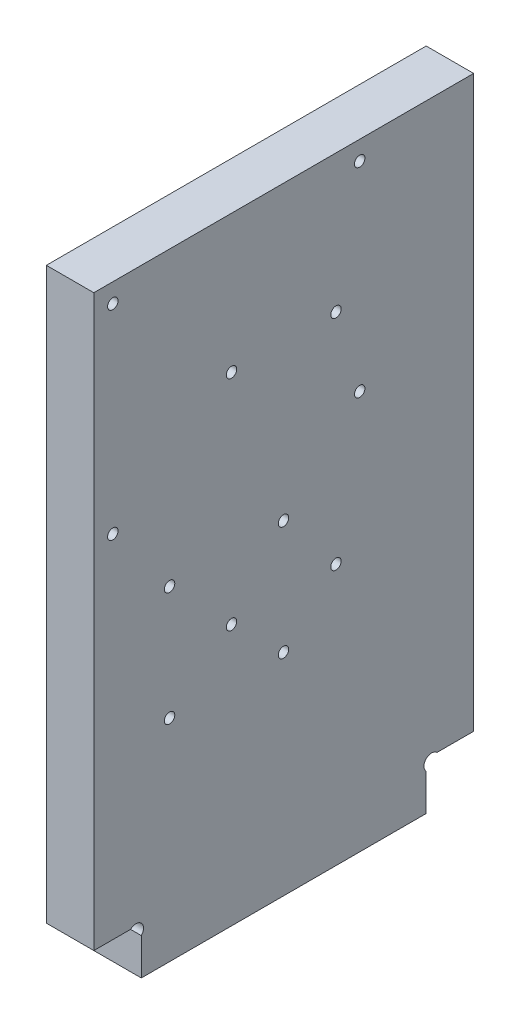
ISO-10303-21;
HEADER;
FILE_DESCRIPTION(('STEP AP214'),'2;1');
FILE_NAME('part.step','',(''),(''),'','','');
FILE_SCHEMA(('AUTOMOTIVE_DESIGN { 1 0 10303 214 1 1 1 1 }'));
ENDSEC;
DATA;
#1=APPLICATION_CONTEXT('core data for automotive mechanical design processes');
#2=APPLICATION_PROTOCOL_DEFINITION('international standard','automotive_design',2000,#1);
#3=PRODUCT_CONTEXT('',#1,'mechanical');
#4=PRODUCT('Part','Part','',(#3));
#5=PRODUCT_RELATED_PRODUCT_CATEGORY('part','',(#4));
#6=PRODUCT_DEFINITION_FORMATION('','',#4);
#7=PRODUCT_DEFINITION_CONTEXT('part definition',#1,'design');
#8=PRODUCT_DEFINITION('design','',#6,#7);
#9=PRODUCT_DEFINITION_SHAPE('','',#8);
#10=(LENGTH_UNIT() NAMED_UNIT(*) SI_UNIT(.MILLI.,.METRE.));
#11=(NAMED_UNIT(*) PLANE_ANGLE_UNIT() SI_UNIT($,.RADIAN.));
#12=(NAMED_UNIT(*) SI_UNIT($,.STERADIAN.) SOLID_ANGLE_UNIT());
#13=UNCERTAINTY_MEASURE_WITH_UNIT(LENGTH_MEASURE(1.E-05),#10,'distance_accuracy_value','');
#14=(GEOMETRIC_REPRESENTATION_CONTEXT(3) GLOBAL_UNCERTAINTY_ASSIGNED_CONTEXT((#13)) GLOBAL_UNIT_ASSIGNED_CONTEXT((#10,
#11,#12)) REPRESENTATION_CONTEXT('',''));
#15=CARTESIAN_POINT('',(0.,0.,0.));
#16=DIRECTION('',(0.,0.,1.));
#17=DIRECTION('',(1.,0.,0.));
#18=AXIS2_PLACEMENT_3D('',#15,#16,#17);
#19=CARTESIAN_POINT('',(10.,8.86862915010153,-8.86862915010152));
#20=DIRECTION('',(1.,0.,0.));
#21=DIRECTION('',(0.,0.,-1.));
#22=AXIS2_PLACEMENT_3D('',#19,#20,#21);
#23=PLANE('',#22);
#24=CARTESIAN_POINT('',(10.,68.45,-39.95));
#25=DIRECTION('',(1.,0.,0.));
#26=DIRECTION('',(0.,0.,-1.));
#27=AXIS2_PLACEMENT_3D('',#24,#25,#26);
#28=CIRCLE('',#27,1.1);
#29=CARTESIAN_POINT('',(10.,68.45,-41.05));
#30=VERTEX_POINT('',#29);
#31=EDGE_CURVE('E318',#30,#30,#28,.T.);
#32=ORIENTED_EDGE('',*,*,#31,.F.);
#33=EDGE_LOOP('',(#32));
#34=FACE_BOUND('',#33,.T.);
#35=CARTESIAN_POINT('',(10.,44.45,-39.95));
#36=DIRECTION('',(1.,0.,0.));
#37=DIRECTION('',(0.,0.,-1.));
#38=AXIS2_PLACEMENT_3D('',#35,#36,#37);
#39=CIRCLE('',#38,1.1);
#40=CARTESIAN_POINT('',(10.,44.45,-41.05));
#41=VERTEX_POINT('',#40);
#42=EDGE_CURVE('E317',#41,#41,#39,.T.);
#43=ORIENTED_EDGE('',*,*,#42,.F.);
#44=EDGE_LOOP('',(#43));
#45=FACE_BOUND('',#44,.T.);
#46=CARTESIAN_POINT('',(10.,44.45,-15.95));
#47=DIRECTION('',(1.,0.,0.));
#48=DIRECTION('',(0.,0.,-1.));
#49=AXIS2_PLACEMENT_3D('',#46,#47,#48);
#50=CIRCLE('',#49,1.1);
#51=CARTESIAN_POINT('',(10.,44.45,-17.05));
#52=VERTEX_POINT('',#51);
#53=EDGE_CURVE('E328',#52,#52,#50,.T.);
#54=ORIENTED_EDGE('',*,*,#53,.F.);
#55=EDGE_LOOP('',(#54));
#56=FACE_BOUND('',#55,.T.);
#57=CARTESIAN_POINT('',(10.,68.45,-15.95));
#58=DIRECTION('',(1.,0.,0.));
#59=DIRECTION('',(0.,0.,-1.));
#60=AXIS2_PLACEMENT_3D('',#57,#58,#59);
#61=CIRCLE('',#60,1.1);
#62=CARTESIAN_POINT('',(10.,68.45,-17.05));
#63=VERTEX_POINT('',#62);
#64=EDGE_CURVE('E334',#63,#63,#61,.T.);
#65=ORIENTED_EDGE('',*,*,#64,.F.);
#66=EDGE_LOOP('',(#65));
#67=FACE_BOUND('',#66,.T.);
#68=CARTESIAN_POINT('',(10.,84.,-56.));
#69=DIRECTION('',(1.,0.,0.));
#70=DIRECTION('',(0.,0.,-1.));
#71=AXIS2_PLACEMENT_3D('',#68,#69,#70);
#72=CIRCLE('',#71,1.09999999999999);
#73=CARTESIAN_POINT('',(10.,84.,-57.1));
#74=VERTEX_POINT('',#73);
#75=EDGE_CURVE('E340',#74,#74,#72,.T.);
#76=ORIENTED_EDGE('',*,*,#75,.F.);
#77=EDGE_LOOP('',(#76));
#78=FACE_BOUND('',#77,.T.);
#79=CARTESIAN_POINT('',(10.,84.,-4.));
#80=DIRECTION('',(1.,0.,0.));
#81=DIRECTION('',(0.,0.,1.));
#82=AXIS2_PLACEMENT_3D('',#79,#80,#81);
#83=CIRCLE('',#82,1.1);
#84=CARTESIAN_POINT('',(10.,84.,-2.9));
#85=VERTEX_POINT('',#84);
#86=EDGE_CURVE('E346',#85,#85,#83,.T.);
#87=ORIENTED_EDGE('',*,*,#86,.F.);
#88=EDGE_LOOP('',(#87));
#89=FACE_BOUND('',#88,.T.);
#90=CARTESIAN_POINT('',(10.,126.,-56.));
#91=DIRECTION('',(1.,0.,0.));
#92=DIRECTION('',(0.,0.,1.));
#93=AXIS2_PLACEMENT_3D('',#90,#91,#92);
#94=CIRCLE('',#93,1.09999999999999);
#95=CARTESIAN_POINT('',(10.,126.,-54.9));
#96=VERTEX_POINT('',#95);
#97=EDGE_CURVE('E352',#96,#96,#94,.T.);
#98=ORIENTED_EDGE('',*,*,#97,.F.);
#99=EDGE_LOOP('',(#98));
#100=FACE_BOUND('',#99,.T.);
#101=CARTESIAN_POINT('',(10.,126.,-4.));
#102=DIRECTION('',(1.,0.,0.));
#103=DIRECTION('',(0.,0.,-1.));
#104=AXIS2_PLACEMENT_3D('',#101,#102,#103);
#105=CIRCLE('',#104,1.1);
#106=CARTESIAN_POINT('',(10.,126.,-5.1));
#107=VERTEX_POINT('',#106);
#108=EDGE_CURVE('E358',#107,#107,#105,.T.);
#109=ORIENTED_EDGE('',*,*,#108,.F.);
#110=EDGE_LOOP('',(#109));
#111=FACE_BOUND('',#110,.T.);
#112=CARTESIAN_POINT('',(10.,55.,-29.));
#113=DIRECTION('',(1.,0.,0.));
#114=DIRECTION('',(0.,0.,1.));
#115=AXIS2_PLACEMENT_3D('',#112,#113,#114);
#116=CIRCLE('',#115,1.1);
#117=CARTESIAN_POINT('',(10.,55.,-27.9));
#118=VERTEX_POINT('',#117);
#119=EDGE_CURVE('E373',#118,#118,#116,.T.);
#120=ORIENTED_EDGE('',*,*,#119,.F.);
#121=EDGE_LOOP('',(#120));
#122=FACE_BOUND('',#121,.T.);
#123=CARTESIAN_POINT('',(10.,101.,-29.));
#124=DIRECTION('',(1.,0.,0.));
#125=DIRECTION('',(0.,0.,-1.));
#126=AXIS2_PLACEMENT_3D('',#123,#124,#125);
#127=CIRCLE('',#126,1.1);
#128=CARTESIAN_POINT('',(10.,101.,-30.1));
#129=VERTEX_POINT('',#128);
#130=EDGE_CURVE('E122',#129,#129,#127,.T.);
#131=ORIENTED_EDGE('',*,*,#130,.F.);
#132=EDGE_LOOP('',(#131));
#133=FACE_BOUND('',#132,.T.);
#134=CARTESIAN_POINT('',(10.,8.86862915010153,-8.86862915010152));
#135=DIRECTION('',(-1.,0.,0.));
#136=DIRECTION('',(0.,0.,-1.));
#137=AXIS2_PLACEMENT_3D('',#134,#135,#136);
#138=CIRCLE('',#137,1.6);
#139=CARTESIAN_POINT('',(10.,10.,-7.73725830020304));
#140=VERTEX_POINT('',#139);
#141=CARTESIAN_POINT('',(10.,7.73725830020305,-10.));
#142=VERTEX_POINT('',#141);
#143=EDGE_CURVE('E144',#140,#142,#138,.T.);
#144=ORIENTED_EDGE('',*,*,#143,.T.);
#145=DIRECTION('',(0.,-1.,0.));
#146=VECTOR('',#145,1.);
#147=CARTESIAN_POINT('',(10.,7.73725830020305,-10.));
#148=LINE('',#147,#146);
#149=CARTESIAN_POINT('',(10.,0.,-10.));
#150=VERTEX_POINT('',#149);
#151=EDGE_CURVE('E117',#142,#150,#148,.T.);
#152=ORIENTED_EDGE('',*,*,#151,.T.);
#153=DIRECTION('',(0.,0.,-1.));
#154=VECTOR('',#153,1.);
#155=CARTESIAN_POINT('',(10.,0.,-10.));
#156=LINE('',#155,#154);
#157=CARTESIAN_POINT('',(10.,0.,-70.));
#158=VERTEX_POINT('',#157);
#159=EDGE_CURVE('E147',#150,#158,#156,.T.);
#160=ORIENTED_EDGE('',*,*,#159,.T.);
#161=DIRECTION('',(0.,1.,0.));
#162=VECTOR('',#161,1.);
#163=CARTESIAN_POINT('',(10.,7.73725830020305,-70.));
#164=LINE('',#163,#162);
#165=CARTESIAN_POINT('',(10.,7.73725830020305,-70.));
#166=VERTEX_POINT('',#165);
#167=EDGE_CURVE('E149',#158,#166,#164,.T.);
#168=ORIENTED_EDGE('',*,*,#167,.T.);
#169=CARTESIAN_POINT('',(10.,8.86862915010153,-71.1313708498985));
#170=DIRECTION('',(-1.,0.,0.));
#171=DIRECTION('',(0.,0.,1.));
#172=AXIS2_PLACEMENT_3D('',#169,#170,#171);
#173=CIRCLE('',#172,1.6);
#174=CARTESIAN_POINT('',(10.,10.,-72.262741699797));
#175=VERTEX_POINT('',#174);
#176=EDGE_CURVE('E151',#166,#175,#173,.T.);
#177=ORIENTED_EDGE('',*,*,#176,.T.);
#178=DIRECTION('',(0.,0.,-1.));
#179=VECTOR('',#178,1.);
#180=CARTESIAN_POINT('',(10.,10.,-72.262741699797));
#181=LINE('',#180,#179);
#182=CARTESIAN_POINT('',(10.,10.,-80.));
#183=VERTEX_POINT('',#182);
#184=EDGE_CURVE('E153',#175,#183,#181,.T.);
#185=ORIENTED_EDGE('',*,*,#184,.T.);
#186=DIRECTION('',(0.,1.,0.));
#187=VECTOR('',#186,1.);
#188=CARTESIAN_POINT('',(10.,130.,-80.));
#189=LINE('',#188,#187);
#190=CARTESIAN_POINT('',(10.,130.,-80.));
#191=VERTEX_POINT('',#190);
#192=EDGE_CURVE('E155',#183,#191,#189,.T.);
#193=ORIENTED_EDGE('',*,*,#192,.T.);
#194=DIRECTION('',(0.,0.,1.));
#195=VECTOR('',#194,1.);
#196=CARTESIAN_POINT('',(10.,130.,0.));
#197=LINE('',#196,#195);
#198=CARTESIAN_POINT('',(10.,130.,0.));
#199=VERTEX_POINT('',#198);
#200=EDGE_CURVE('E157',#191,#199,#197,.T.);
#201=ORIENTED_EDGE('',*,*,#200,.T.);
#202=DIRECTION('',(0.,-1.,0.));
#203=VECTOR('',#202,1.);
#204=CARTESIAN_POINT('',(10.,10.,0.));
#205=LINE('',#204,#203);
#206=CARTESIAN_POINT('',(10.,10.,0.));
#207=VERTEX_POINT('',#206);
#208=EDGE_CURVE('E46',#199,#207,#205,.T.);
#209=ORIENTED_EDGE('',*,*,#208,.T.);
#210=DIRECTION('',(0.,0.,-1.));
#211=VECTOR('',#210,1.);
#212=CARTESIAN_POINT('',(10.,10.,-7.73725830020304));
#213=LINE('',#212,#211);
#214=EDGE_CURVE('E41',#207,#140,#213,.T.);
#215=ORIENTED_EDGE('',*,*,#214,.T.);
#216=EDGE_LOOP('',(#144,#152,#160,#168,#177,#185,#193,#201,#209,#215));
#217=FACE_BOUND('',#216,.T.);
#218=CARTESIAN_POINT('',(10.,101.,-51.));
#219=DIRECTION('',(1.,0.,0.));
#220=DIRECTION('',(0.,0.,1.));
#221=AXIS2_PLACEMENT_3D('',#218,#219,#220);
#222=CIRCLE('',#221,1.09999999999999);
#223=CARTESIAN_POINT('',(10.,101.,-49.9));
#224=VERTEX_POINT('',#223);
#225=EDGE_CURVE('E379',#224,#224,#222,.T.);
#226=ORIENTED_EDGE('',*,*,#225,.F.);
#227=EDGE_LOOP('',(#226));
#228=FACE_BOUND('',#227,.T.);
#229=CARTESIAN_POINT('',(10.,55.,-51.));
#230=DIRECTION('',(1.,0.,0.));
#231=DIRECTION('',(0.,0.,-1.));
#232=AXIS2_PLACEMENT_3D('',#229,#230,#231);
#233=CIRCLE('',#232,1.09999999999999);
#234=CARTESIAN_POINT('',(10.,55.,-52.1));
#235=VERTEX_POINT('',#234);
#236=EDGE_CURVE('E367',#235,#235,#233,.T.);
#237=ORIENTED_EDGE('',*,*,#236,.F.);
#238=EDGE_LOOP('',(#237));
#239=FACE_BOUND('',#238,.T.);
#240=ADVANCED_FACE('F26',(#34,#45,#56,#67,#78,#89,#100,#111,#122,#133,#217,#228,#239),#23,.T.);
#241=CARTESIAN_POINT('',(0.,8.86862915010153,-8.86862915010152));
#242=DIRECTION('',(1.,0.,0.));
#243=DIRECTION('',(0.,0.,-1.));
#244=AXIS2_PLACEMENT_3D('',#241,#242,#243);
#245=PLANE('',#244);
#246=CARTESIAN_POINT('',(0.,55.,-29.));
#247=DIRECTION('',(1.,0.,0.));
#248=DIRECTION('',(0.,0.,1.));
#249=AXIS2_PLACEMENT_3D('',#246,#247,#248);
#250=CIRCLE('',#249,1.1);
#251=CARTESIAN_POINT('',(0.,55.,-27.9));
#252=VERTEX_POINT('',#251);
#253=EDGE_CURVE('E370',#252,#252,#250,.T.);
#254=ORIENTED_EDGE('',*,*,#253,.T.);
#255=EDGE_LOOP('',(#254));
#256=FACE_BOUND('',#255,.T.);
#257=CARTESIAN_POINT('',(0.,101.,-29.));
#258=DIRECTION('',(1.,0.,0.));
#259=DIRECTION('',(0.,0.,-1.));
#260=AXIS2_PLACEMENT_3D('',#257,#258,#259);
#261=CIRCLE('',#260,1.1);
#262=CARTESIAN_POINT('',(0.,101.,-30.1));
#263=VERTEX_POINT('',#262);
#264=EDGE_CURVE('E125',#263,#263,#261,.T.);
#265=ORIENTED_EDGE('',*,*,#264,.T.);
#266=EDGE_LOOP('',(#265));
#267=FACE_BOUND('',#266,.T.);
#268=CARTESIAN_POINT('',(0.,8.86862915010153,-8.86862915010152));
#269=DIRECTION('',(-1.,0.,0.));
#270=DIRECTION('',(0.,0.,-1.));
#271=AXIS2_PLACEMENT_3D('',#268,#269,#270);
#272=CIRCLE('',#271,1.6);
#273=CARTESIAN_POINT('',(0.,10.,-7.73725830020304));
#274=VERTEX_POINT('',#273);
#275=CARTESIAN_POINT('',(0.,7.73725830020305,-10.));
#276=VERTEX_POINT('',#275);
#277=EDGE_CURVE('E108',#274,#276,#272,.T.);
#278=ORIENTED_EDGE('',*,*,#277,.F.);
#279=DIRECTION('',(0.,0.,-1.));
#280=VECTOR('',#279,1.);
#281=CARTESIAN_POINT('',(0.,10.,-7.73725830020304));
#282=LINE('',#281,#280);
#283=CARTESIAN_POINT('',(0.,10.,0.));
#284=VERTEX_POINT('',#283);
#285=EDGE_CURVE('E142',#284,#274,#282,.T.);
#286=ORIENTED_EDGE('',*,*,#285,.F.);
#287=DIRECTION('',(0.,-1.,0.));
#288=VECTOR('',#287,1.);
#289=CARTESIAN_POINT('',(0.,10.,0.));
#290=LINE('',#289,#288);
#291=CARTESIAN_POINT('',(0.,130.,0.));
#292=VERTEX_POINT('',#291);
#293=EDGE_CURVE('E140',#292,#284,#290,.T.);
#294=ORIENTED_EDGE('',*,*,#293,.F.);
#295=DIRECTION('',(0.,0.,1.));
#296=VECTOR('',#295,1.);
#297=CARTESIAN_POINT('',(0.,130.,0.));
#298=LINE('',#297,#296);
#299=CARTESIAN_POINT('',(0.,130.,-80.));
#300=VERTEX_POINT('',#299);
#301=EDGE_CURVE('E138',#300,#292,#298,.T.);
#302=ORIENTED_EDGE('',*,*,#301,.F.);
#303=DIRECTION('',(0.,1.,0.));
#304=VECTOR('',#303,1.);
#305=CARTESIAN_POINT('',(0.,130.,-80.));
#306=LINE('',#305,#304);
#307=CARTESIAN_POINT('',(0.,10.,-80.));
#308=VERTEX_POINT('',#307);
#309=EDGE_CURVE('E136',#308,#300,#306,.T.);
#310=ORIENTED_EDGE('',*,*,#309,.F.);
#311=DIRECTION('',(0.,0.,-1.));
#312=VECTOR('',#311,1.);
#313=CARTESIAN_POINT('',(0.,10.,-72.262741699797));
#314=LINE('',#313,#312);
#315=CARTESIAN_POINT('',(0.,10.,-72.262741699797));
#316=VERTEX_POINT('',#315);
#317=EDGE_CURVE('E134',#316,#308,#314,.T.);
#318=ORIENTED_EDGE('',*,*,#317,.F.);
#319=CARTESIAN_POINT('',(0.,8.86862915010153,-71.1313708498985));
#320=DIRECTION('',(-1.,0.,0.));
#321=DIRECTION('',(0.,0.,1.));
#322=AXIS2_PLACEMENT_3D('',#319,#320,#321);
#323=CIRCLE('',#322,1.6);
#324=CARTESIAN_POINT('',(0.,7.73725830020305,-70.));
#325=VERTEX_POINT('',#324);
#326=EDGE_CURVE('E132',#325,#316,#323,.T.);
#327=ORIENTED_EDGE('',*,*,#326,.F.);
#328=DIRECTION('',(0.,1.,0.));
#329=VECTOR('',#328,1.);
#330=CARTESIAN_POINT('',(0.,7.73725830020305,-70.));
#331=LINE('',#330,#329);
#332=CARTESIAN_POINT('',(0.,0.,-70.));
#333=VERTEX_POINT('',#332);
#334=EDGE_CURVE('E130',#333,#325,#331,.T.);
#335=ORIENTED_EDGE('',*,*,#334,.F.);
#336=DIRECTION('',(0.,0.,-1.));
#337=VECTOR('',#336,1.);
#338=CARTESIAN_POINT('',(0.,0.,-10.));
#339=LINE('',#338,#337);
#340=CARTESIAN_POINT('',(0.,0.,-10.));
#341=VERTEX_POINT('',#340);
#342=EDGE_CURVE('E110',#341,#333,#339,.T.);
#343=ORIENTED_EDGE('',*,*,#342,.F.);
#344=DIRECTION('',(0.,-1.,0.));
#345=VECTOR('',#344,1.);
#346=CARTESIAN_POINT('',(0.,7.73725830020305,-10.));
#347=LINE('',#346,#345);
#348=EDGE_CURVE('E103',#276,#341,#347,.T.);
#349=ORIENTED_EDGE('',*,*,#348,.F.);
#350=EDGE_LOOP('',(#278,#286,#294,#302,#310,#318,#327,#335,#343,#349));
#351=FACE_BOUND('',#350,.T.);
#352=CARTESIAN_POINT('',(0.,101.,-51.));
#353=DIRECTION('',(1.,0.,0.));
#354=DIRECTION('',(0.,0.,1.));
#355=AXIS2_PLACEMENT_3D('',#352,#353,#354);
#356=CIRCLE('',#355,1.09999999999999);
#357=CARTESIAN_POINT('',(0.,101.,-49.9));
#358=VERTEX_POINT('',#357);
#359=EDGE_CURVE('E376',#358,#358,#356,.T.);
#360=ORIENTED_EDGE('',*,*,#359,.T.);
#361=EDGE_LOOP('',(#360));
#362=FACE_BOUND('',#361,.T.);
#363=CARTESIAN_POINT('',(0.,55.,-51.));
#364=DIRECTION('',(1.,0.,0.));
#365=DIRECTION('',(0.,0.,-1.));
#366=AXIS2_PLACEMENT_3D('',#363,#364,#365);
#367=CIRCLE('',#366,1.09999999999999);
#368=CARTESIAN_POINT('',(0.,55.,-52.1));
#369=VERTEX_POINT('',#368);
#370=EDGE_CURVE('E364',#369,#369,#367,.T.);
#371=ORIENTED_EDGE('',*,*,#370,.T.);
#372=EDGE_LOOP('',(#371));
#373=FACE_BOUND('',#372,.T.);
#374=ADVANCED_FACE('F104',(#256,#267,#351,#362,#373),#245,.F.);
#375=CARTESIAN_POINT('',(10.,8.86862915010153,-8.86862915010152));
#376=DIRECTION('',(-1.,0.,0.));
#377=DIRECTION('',(0.,0.,1.));
#378=AXIS2_PLACEMENT_3D('',#375,#376,#377);
#379=CYLINDRICAL_SURFACE('',#378,1.6);
#380=ORIENTED_EDGE('',*,*,#277,.T.);
#381=DIRECTION('',(-1.,0.,0.));
#382=VECTOR('',#381,1.);
#383=CARTESIAN_POINT('',(10.,7.73725830020305,-10.));
#384=LINE('',#383,#382);
#385=EDGE_CURVE('E11',#142,#276,#384,.T.);
#386=ORIENTED_EDGE('',*,*,#385,.F.);
#387=ORIENTED_EDGE('',*,*,#143,.F.);
#388=DIRECTION('',(-1.,0.,0.));
#389=VECTOR('',#388,1.);
#390=CARTESIAN_POINT('',(10.,10.,-7.73725830020304));
#391=LINE('',#390,#389);
#392=EDGE_CURVE('E121',#140,#274,#391,.T.);
#393=ORIENTED_EDGE('',*,*,#392,.T.);
#394=EDGE_LOOP('',(#380,#386,#387,#393));
#395=FACE_BOUND('',#394,.T.);
#396=ADVANCED_FACE('F28',(#395),#379,.F.);
#397=CARTESIAN_POINT('',(10.,7.73725830020305,-10.));
#398=DIRECTION('',(0.,0.,-1.));
#399=DIRECTION('',(-1.,0.,0.));
#400=AXIS2_PLACEMENT_3D('',#397,#398,#399);
#401=PLANE('',#400);
#402=ORIENTED_EDGE('',*,*,#348,.T.);
#403=DIRECTION('',(-1.,0.,0.));
#404=VECTOR('',#403,1.);
#405=CARTESIAN_POINT('',(10.,0.,-10.));
#406=LINE('',#405,#404);
#407=EDGE_CURVE('E34',#150,#341,#406,.T.);
#408=ORIENTED_EDGE('',*,*,#407,.F.);
#409=ORIENTED_EDGE('',*,*,#151,.F.);
#410=ORIENTED_EDGE('',*,*,#385,.T.);
#411=EDGE_LOOP('',(#402,#408,#409,#410));
#412=FACE_BOUND('',#411,.T.);
#413=ADVANCED_FACE('F116',(#412),#401,.F.);
#414=CARTESIAN_POINT('',(10.,0.,-10.));
#415=DIRECTION('',(0.,1.,0.));
#416=DIRECTION('',(0.,0.,1.));
#417=AXIS2_PLACEMENT_3D('',#414,#415,#416);
#418=PLANE('',#417);
#419=ORIENTED_EDGE('',*,*,#342,.T.);
#420=DIRECTION('',(-1.,0.,0.));
#421=VECTOR('',#420,1.);
#422=CARTESIAN_POINT('',(10.,0.,-70.));
#423=LINE('',#422,#421);
#424=EDGE_CURVE('E180',#158,#333,#423,.T.);
#425=ORIENTED_EDGE('',*,*,#424,.F.);
#426=ORIENTED_EDGE('',*,*,#159,.F.);
#427=ORIENTED_EDGE('',*,*,#407,.T.);
#428=EDGE_LOOP('',(#419,#425,#426,#427));
#429=FACE_BOUND('',#428,.T.);
#430=ADVANCED_FACE('F184',(#429),#418,.F.);
#431=CARTESIAN_POINT('',(10.,7.73725830020305,-70.));
#432=DIRECTION('',(0.,0.,1.));
#433=DIRECTION('',(1.,0.,0.));
#434=AXIS2_PLACEMENT_3D('',#431,#432,#433);
#435=PLANE('',#434);
#436=ORIENTED_EDGE('',*,*,#334,.T.);
#437=DIRECTION('',(-1.,0.,0.));
#438=VECTOR('',#437,1.);
#439=CARTESIAN_POINT('',(10.,7.73725830020305,-70.));
#440=LINE('',#439,#438);
#441=EDGE_CURVE('E177',#166,#325,#440,.T.);
#442=ORIENTED_EDGE('',*,*,#441,.F.);
#443=ORIENTED_EDGE('',*,*,#167,.F.);
#444=ORIENTED_EDGE('',*,*,#424,.T.);
#445=EDGE_LOOP('',(#436,#442,#443,#444));
#446=FACE_BOUND('',#445,.T.);
#447=ADVANCED_FACE('F192',(#446),#435,.F.);
#448=CARTESIAN_POINT('',(10.,8.86862915010153,-71.1313708498985));
#449=DIRECTION('',(-1.,0.,0.));
#450=DIRECTION('',(0.,0.,1.));
#451=AXIS2_PLACEMENT_3D('',#448,#449,#450);
#452=CYLINDRICAL_SURFACE('',#451,1.6);
#453=ORIENTED_EDGE('',*,*,#326,.T.);
#454=DIRECTION('',(-1.,0.,0.));
#455=VECTOR('',#454,1.);
#456=CARTESIAN_POINT('',(10.,10.,-72.262741699797));
#457=LINE('',#456,#455);
#458=EDGE_CURVE('E174',#175,#316,#457,.T.);
#459=ORIENTED_EDGE('',*,*,#458,.F.);
#460=ORIENTED_EDGE('',*,*,#176,.F.);
#461=ORIENTED_EDGE('',*,*,#441,.T.);
#462=EDGE_LOOP('',(#453,#459,#460,#461));
#463=FACE_BOUND('',#462,.T.);
#464=ADVANCED_FACE('F195',(#463),#452,.F.);
#465=CARTESIAN_POINT('',(10.,10.,-72.262741699797));
#466=DIRECTION('',(0.,1.,0.));
#467=DIRECTION('',(0.,0.,1.));
#468=AXIS2_PLACEMENT_3D('',#465,#466,#467);
#469=PLANE('',#468);
#470=ORIENTED_EDGE('',*,*,#317,.T.);
#471=DIRECTION('',(-1.,0.,0.));
#472=VECTOR('',#471,1.);
#473=CARTESIAN_POINT('',(10.,10.,-80.));
#474=LINE('',#473,#472);
#475=EDGE_CURVE('E171',#183,#308,#474,.T.);
#476=ORIENTED_EDGE('',*,*,#475,.F.);
#477=ORIENTED_EDGE('',*,*,#184,.F.);
#478=ORIENTED_EDGE('',*,*,#458,.T.);
#479=EDGE_LOOP('',(#470,#476,#477,#478));
#480=FACE_BOUND('',#479,.T.);
#481=ADVANCED_FACE('F200',(#480),#469,.F.);
#482=CARTESIAN_POINT('',(10.,130.,-80.));
#483=DIRECTION('',(0.,0.,1.));
#484=DIRECTION('',(1.,0.,0.));
#485=AXIS2_PLACEMENT_3D('',#482,#483,#484);
#486=PLANE('',#485);
#487=ORIENTED_EDGE('',*,*,#309,.T.);
#488=DIRECTION('',(-1.,0.,0.));
#489=VECTOR('',#488,1.);
#490=CARTESIAN_POINT('',(10.,130.,-80.));
#491=LINE('',#490,#489);
#492=EDGE_CURVE('E168',#191,#300,#491,.T.);
#493=ORIENTED_EDGE('',*,*,#492,.F.);
#494=ORIENTED_EDGE('',*,*,#192,.F.);
#495=ORIENTED_EDGE('',*,*,#475,.T.);
#496=EDGE_LOOP('',(#487,#493,#494,#495));
#497=FACE_BOUND('',#496,.T.);
#498=ADVANCED_FACE('F206',(#497),#486,.F.);
#499=CARTESIAN_POINT('',(10.,130.,0.));
#500=DIRECTION('',(0.,-1.,0.));
#501=DIRECTION('',(0.,0.,-1.));
#502=AXIS2_PLACEMENT_3D('',#499,#500,#501);
#503=PLANE('',#502);
#504=ORIENTED_EDGE('',*,*,#301,.T.);
#505=DIRECTION('',(-1.,0.,0.));
#506=VECTOR('',#505,1.);
#507=CARTESIAN_POINT('',(10.,130.,0.));
#508=LINE('',#507,#506);
#509=EDGE_CURVE('E165',#199,#292,#508,.T.);
#510=ORIENTED_EDGE('',*,*,#509,.F.);
#511=ORIENTED_EDGE('',*,*,#200,.F.);
#512=ORIENTED_EDGE('',*,*,#492,.T.);
#513=EDGE_LOOP('',(#504,#510,#511,#512));
#514=FACE_BOUND('',#513,.T.);
#515=ADVANCED_FACE('F210',(#514),#503,.F.);
#516=CARTESIAN_POINT('',(10.,10.,0.));
#517=DIRECTION('',(0.,0.,-1.));
#518=DIRECTION('',(-1.,0.,0.));
#519=AXIS2_PLACEMENT_3D('',#516,#517,#518);
#520=PLANE('',#519);
#521=ORIENTED_EDGE('',*,*,#293,.T.);
#522=DIRECTION('',(-1.,0.,0.));
#523=VECTOR('',#522,1.);
#524=CARTESIAN_POINT('',(10.,10.,0.));
#525=LINE('',#524,#523);
#526=EDGE_CURVE('E162',#207,#284,#525,.T.);
#527=ORIENTED_EDGE('',*,*,#526,.F.);
#528=ORIENTED_EDGE('',*,*,#208,.F.);
#529=ORIENTED_EDGE('',*,*,#509,.T.);
#530=EDGE_LOOP('',(#521,#527,#528,#529));
#531=FACE_BOUND('',#530,.T.);
#532=ADVANCED_FACE('F213',(#531),#520,.F.);
#533=CARTESIAN_POINT('',(10.,10.,-7.73725830020304));
#534=DIRECTION('',(0.,1.,0.));
#535=DIRECTION('',(0.,0.,1.));
#536=AXIS2_PLACEMENT_3D('',#533,#534,#535);
#537=PLANE('',#536);
#538=ORIENTED_EDGE('',*,*,#285,.T.);
#539=ORIENTED_EDGE('',*,*,#392,.F.);
#540=ORIENTED_EDGE('',*,*,#214,.F.);
#541=ORIENTED_EDGE('',*,*,#526,.T.);
#542=EDGE_LOOP('',(#538,#539,#540,#541));
#543=FACE_BOUND('',#542,.T.);
#544=ADVANCED_FACE('F215',(#543),#537,.F.);
#545=CARTESIAN_POINT('',(10.,101.,-29.));
#546=DIRECTION('',(-1.,0.,0.));
#547=DIRECTION('',(0.,0.,1.));
#548=AXIS2_PLACEMENT_3D('',#545,#546,#547);
#549=CYLINDRICAL_SURFACE('',#548,1.1);
#550=ORIENTED_EDGE('',*,*,#130,.T.);
#551=EDGE_LOOP('',(#550));
#552=FACE_BOUND('',#551,.T.);
#553=ORIENTED_EDGE('',*,*,#264,.F.);
#554=EDGE_LOOP('',(#553));
#555=FACE_BOUND('',#554,.T.);
#556=ADVANCED_FACE('F217',(#552,#555),#549,.F.);
#557=CARTESIAN_POINT('',(10.,101.,-51.));
#558=DIRECTION('',(-1.,0.,0.));
#559=DIRECTION('',(0.,0.,1.));
#560=AXIS2_PLACEMENT_3D('',#557,#558,#559);
#561=CYLINDRICAL_SURFACE('',#560,1.09999999999999);
#562=ORIENTED_EDGE('',*,*,#225,.T.);
#563=EDGE_LOOP('',(#562));
#564=FACE_BOUND('',#563,.T.);
#565=ORIENTED_EDGE('',*,*,#359,.F.);
#566=EDGE_LOOP('',(#565));
#567=FACE_BOUND('',#566,.T.);
#568=ADVANCED_FACE('F223',(#564,#567),#561,.F.);
#569=CARTESIAN_POINT('',(10.,55.,-29.));
#570=DIRECTION('',(-1.,0.,0.));
#571=DIRECTION('',(0.,0.,1.));
#572=AXIS2_PLACEMENT_3D('',#569,#570,#571);
#573=CYLINDRICAL_SURFACE('',#572,1.1);
#574=ORIENTED_EDGE('',*,*,#119,.T.);
#575=EDGE_LOOP('',(#574));
#576=FACE_BOUND('',#575,.T.);
#577=ORIENTED_EDGE('',*,*,#253,.F.);
#578=EDGE_LOOP('',(#577));
#579=FACE_BOUND('',#578,.T.);
#580=ADVANCED_FACE('F242',(#576,#579),#573,.F.);
#581=CARTESIAN_POINT('',(10.,55.,-51.));
#582=DIRECTION('',(-1.,0.,0.));
#583=DIRECTION('',(0.,0.,1.));
#584=AXIS2_PLACEMENT_3D('',#581,#582,#583);
#585=CYLINDRICAL_SURFACE('',#584,1.09999999999999);
#586=ORIENTED_EDGE('',*,*,#236,.T.);
#587=EDGE_LOOP('',(#586));
#588=FACE_BOUND('',#587,.T.);
#589=ORIENTED_EDGE('',*,*,#370,.F.);
#590=EDGE_LOOP('',(#589));
#591=FACE_BOUND('',#590,.T.);
#592=ADVANCED_FACE('F246',(#588,#591),#585,.F.);
#593=CARTESIAN_POINT('',(8.,126.,-4.));
#594=DIRECTION('',(1.,0.,0.));
#595=DIRECTION('',(0.,0.,-1.));
#596=AXIS2_PLACEMENT_3D('',#593,#594,#595);
#597=CYLINDRICAL_SURFACE('',#596,1.1);
#598=CARTESIAN_POINT('',(8.,126.,-4.));
#599=DIRECTION('',(1.,0.,0.));
#600=DIRECTION('',(0.,0.,-1.));
#601=AXIS2_PLACEMENT_3D('',#598,#599,#600);
#602=CIRCLE('',#601,1.1);
#603=CARTESIAN_POINT('',(8.,126.,-5.1));
#604=VERTEX_POINT('',#603);
#605=EDGE_CURVE('E361',#604,#604,#602,.T.);
#606=ORIENTED_EDGE('',*,*,#605,.F.);
#607=EDGE_LOOP('',(#606));
#608=FACE_BOUND('',#607,.T.);
#609=ORIENTED_EDGE('',*,*,#108,.T.);
#610=EDGE_LOOP('',(#609));
#611=FACE_BOUND('',#610,.T.);
#612=ADVANCED_FACE('F249',(#608,#611),#597,.F.);
#613=CARTESIAN_POINT('',(8.,126.,-4.));
#614=DIRECTION('',(1.,0.,0.));
#615=DIRECTION('',(0.,0.,-1.));
#616=AXIS2_PLACEMENT_3D('',#613,#614,#615);
#617=PLANE('',#616);
#618=ORIENTED_EDGE('',*,*,#605,.T.);
#619=EDGE_LOOP('',(#618));
#620=FACE_BOUND('',#619,.T.);
#621=ADVANCED_FACE('F252',(#620),#617,.T.);
#622=CARTESIAN_POINT('',(8.,126.,-56.));
#623=DIRECTION('',(1.,0.,0.));
#624=DIRECTION('',(0.,0.,-1.));
#625=AXIS2_PLACEMENT_3D('',#622,#623,#624);
#626=CYLINDRICAL_SURFACE('',#625,1.09999999999999);
#627=CARTESIAN_POINT('',(8.,126.,-56.));
#628=DIRECTION('',(1.,0.,0.));
#629=DIRECTION('',(0.,0.,1.));
#630=AXIS2_PLACEMENT_3D('',#627,#628,#629);
#631=CIRCLE('',#630,1.09999999999999);
#632=CARTESIAN_POINT('',(8.,126.,-54.9));
#633=VERTEX_POINT('',#632);
#634=EDGE_CURVE('E355',#633,#633,#631,.T.);
#635=ORIENTED_EDGE('',*,*,#634,.F.);
#636=EDGE_LOOP('',(#635));
#637=FACE_BOUND('',#636,.T.);
#638=ORIENTED_EDGE('',*,*,#97,.T.);
#639=EDGE_LOOP('',(#638));
#640=FACE_BOUND('',#639,.T.);
#641=ADVANCED_FACE('F256',(#637,#640),#626,.F.);
#642=CARTESIAN_POINT('',(8.,126.,-56.));
#643=DIRECTION('',(-1.,0.,0.));
#644=DIRECTION('',(0.,0.,1.));
#645=AXIS2_PLACEMENT_3D('',#642,#643,#644);
#646=PLANE('',#645);
#647=ORIENTED_EDGE('',*,*,#634,.T.);
#648=EDGE_LOOP('',(#647));
#649=FACE_BOUND('',#648,.T.);
#650=ADVANCED_FACE('F260',(#649),#646,.F.);
#651=CARTESIAN_POINT('',(8.,84.,-4.));
#652=DIRECTION('',(1.,0.,0.));
#653=DIRECTION('',(0.,0.,-1.));
#654=AXIS2_PLACEMENT_3D('',#651,#652,#653);
#655=CYLINDRICAL_SURFACE('',#654,1.1);
#656=CARTESIAN_POINT('',(8.,84.,-4.));
#657=DIRECTION('',(1.,0.,0.));
#658=DIRECTION('',(0.,0.,1.));
#659=AXIS2_PLACEMENT_3D('',#656,#657,#658);
#660=CIRCLE('',#659,1.1);
#661=CARTESIAN_POINT('',(8.,84.,-2.9));
#662=VERTEX_POINT('',#661);
#663=EDGE_CURVE('E349',#662,#662,#660,.T.);
#664=ORIENTED_EDGE('',*,*,#663,.F.);
#665=EDGE_LOOP('',(#664));
#666=FACE_BOUND('',#665,.T.);
#667=ORIENTED_EDGE('',*,*,#86,.T.);
#668=EDGE_LOOP('',(#667));
#669=FACE_BOUND('',#668,.T.);
#670=ADVANCED_FACE('F264',(#666,#669),#655,.F.);
#671=CARTESIAN_POINT('',(8.,84.,-4.));
#672=DIRECTION('',(-1.,0.,0.));
#673=DIRECTION('',(0.,0.,1.));
#674=AXIS2_PLACEMENT_3D('',#671,#672,#673);
#675=PLANE('',#674);
#676=ORIENTED_EDGE('',*,*,#663,.T.);
#677=EDGE_LOOP('',(#676));
#678=FACE_BOUND('',#677,.T.);
#679=ADVANCED_FACE('F268',(#678),#675,.F.);
#680=CARTESIAN_POINT('',(8.,84.,-56.));
#681=DIRECTION('',(1.,0.,0.));
#682=DIRECTION('',(0.,0.,-1.));
#683=AXIS2_PLACEMENT_3D('',#680,#681,#682);
#684=CYLINDRICAL_SURFACE('',#683,1.09999999999999);
#685=CARTESIAN_POINT('',(8.,84.,-56.));
#686=DIRECTION('',(1.,0.,0.));
#687=DIRECTION('',(0.,0.,-1.));
#688=AXIS2_PLACEMENT_3D('',#685,#686,#687);
#689=CIRCLE('',#688,1.09999999999999);
#690=CARTESIAN_POINT('',(8.,84.,-57.1));
#691=VERTEX_POINT('',#690);
#692=EDGE_CURVE('E343',#691,#691,#689,.T.);
#693=ORIENTED_EDGE('',*,*,#692,.F.);
#694=EDGE_LOOP('',(#693));
#695=FACE_BOUND('',#694,.T.);
#696=ORIENTED_EDGE('',*,*,#75,.T.);
#697=EDGE_LOOP('',(#696));
#698=FACE_BOUND('',#697,.T.);
#699=ADVANCED_FACE('F272',(#695,#698),#684,.F.);
#700=CARTESIAN_POINT('',(8.,84.,-56.));
#701=DIRECTION('',(1.,0.,0.));
#702=DIRECTION('',(0.,0.,-1.));
#703=AXIS2_PLACEMENT_3D('',#700,#701,#702);
#704=PLANE('',#703);
#705=ORIENTED_EDGE('',*,*,#692,.T.);
#706=EDGE_LOOP('',(#705));
#707=FACE_BOUND('',#706,.T.);
#708=ADVANCED_FACE('F276',(#707),#704,.T.);
#709=CARTESIAN_POINT('',(8.,68.45,-15.95));
#710=DIRECTION('',(1.,0.,0.));
#711=DIRECTION('',(0.,0.,-1.));
#712=AXIS2_PLACEMENT_3D('',#709,#710,#711);
#713=CYLINDRICAL_SURFACE('',#712,1.1);
#714=CARTESIAN_POINT('',(8.,68.45,-15.95));
#715=DIRECTION('',(1.,0.,0.));
#716=DIRECTION('',(0.,0.,-1.));
#717=AXIS2_PLACEMENT_3D('',#714,#715,#716);
#718=CIRCLE('',#717,1.1);
#719=CARTESIAN_POINT('',(8.,68.45,-17.05));
#720=VERTEX_POINT('',#719);
#721=EDGE_CURVE('E337',#720,#720,#718,.T.);
#722=ORIENTED_EDGE('',*,*,#721,.F.);
#723=EDGE_LOOP('',(#722));
#724=FACE_BOUND('',#723,.T.);
#725=ORIENTED_EDGE('',*,*,#64,.T.);
#726=EDGE_LOOP('',(#725));
#727=FACE_BOUND('',#726,.T.);
#728=ADVANCED_FACE('F280',(#724,#727),#713,.F.);
#729=CARTESIAN_POINT('',(8.,68.45,-15.95));
#730=DIRECTION('',(1.,0.,0.));
#731=DIRECTION('',(0.,0.,-1.));
#732=AXIS2_PLACEMENT_3D('',#729,#730,#731);
#733=PLANE('',#732);
#734=ORIENTED_EDGE('',*,*,#721,.T.);
#735=EDGE_LOOP('',(#734));
#736=FACE_BOUND('',#735,.T.);
#737=ADVANCED_FACE('F284',(#736),#733,.T.);
#738=CARTESIAN_POINT('',(8.,44.45,-15.95));
#739=DIRECTION('',(1.,0.,0.));
#740=DIRECTION('',(0.,0.,-1.));
#741=AXIS2_PLACEMENT_3D('',#738,#739,#740);
#742=CYLINDRICAL_SURFACE('',#741,1.1);
#743=CARTESIAN_POINT('',(8.,44.45,-15.95));
#744=DIRECTION('',(1.,0.,0.));
#745=DIRECTION('',(0.,0.,-1.));
#746=AXIS2_PLACEMENT_3D('',#743,#744,#745);
#747=CIRCLE('',#746,1.1);
#748=CARTESIAN_POINT('',(8.,44.45,-17.05));
#749=VERTEX_POINT('',#748);
#750=EDGE_CURVE('E331',#749,#749,#747,.T.);
#751=ORIENTED_EDGE('',*,*,#750,.F.);
#752=EDGE_LOOP('',(#751));
#753=FACE_BOUND('',#752,.T.);
#754=ORIENTED_EDGE('',*,*,#53,.T.);
#755=EDGE_LOOP('',(#754));
#756=FACE_BOUND('',#755,.T.);
#757=ADVANCED_FACE('F288',(#753,#756),#742,.F.);
#758=CARTESIAN_POINT('',(8.,44.45,-15.95));
#759=DIRECTION('',(1.,0.,0.));
#760=DIRECTION('',(0.,0.,-1.));
#761=AXIS2_PLACEMENT_3D('',#758,#759,#760);
#762=PLANE('',#761);
#763=ORIENTED_EDGE('',*,*,#750,.T.);
#764=EDGE_LOOP('',(#763));
#765=FACE_BOUND('',#764,.T.);
#766=ADVANCED_FACE('F292',(#765),#762,.T.);
#767=CARTESIAN_POINT('',(8.,44.45,-39.95));
#768=DIRECTION('',(1.,0.,0.));
#769=DIRECTION('',(0.,0.,-1.));
#770=AXIS2_PLACEMENT_3D('',#767,#768,#769);
#771=CYLINDRICAL_SURFACE('',#770,1.1);
#772=CARTESIAN_POINT('',(8.,44.45,-39.95));
#773=DIRECTION('',(1.,0.,0.));
#774=DIRECTION('',(0.,0.,-1.));
#775=AXIS2_PLACEMENT_3D('',#772,#773,#774);
#776=CIRCLE('',#775,1.1);
#777=CARTESIAN_POINT('',(8.,44.45,-41.05));
#778=VERTEX_POINT('',#777);
#779=EDGE_CURVE('E321',#778,#778,#776,.T.);
#780=ORIENTED_EDGE('',*,*,#779,.F.);
#781=EDGE_LOOP('',(#780));
#782=FACE_BOUND('',#781,.T.);
#783=ORIENTED_EDGE('',*,*,#42,.T.);
#784=EDGE_LOOP('',(#783));
#785=FACE_BOUND('',#784,.T.);
#786=ADVANCED_FACE('F296',(#782,#785),#771,.F.);
#787=CARTESIAN_POINT('',(8.,44.45,-39.95));
#788=DIRECTION('',(1.,0.,0.));
#789=DIRECTION('',(0.,0.,-1.));
#790=AXIS2_PLACEMENT_3D('',#787,#788,#789);
#791=PLANE('',#790);
#792=ORIENTED_EDGE('',*,*,#779,.T.);
#793=EDGE_LOOP('',(#792));
#794=FACE_BOUND('',#793,.T.);
#795=ADVANCED_FACE('F300',(#794),#791,.T.);
#796=CARTESIAN_POINT('',(8.,68.45,-39.95));
#797=DIRECTION('',(1.,0.,0.));
#798=DIRECTION('',(0.,0.,-1.));
#799=AXIS2_PLACEMENT_3D('',#796,#797,#798);
#800=CYLINDRICAL_SURFACE('',#799,1.1);
#801=CARTESIAN_POINT('',(8.,68.45,-39.95));
#802=DIRECTION('',(1.,0.,0.));
#803=DIRECTION('',(0.,0.,-1.));
#804=AXIS2_PLACEMENT_3D('',#801,#802,#803);
#805=CIRCLE('',#804,1.1);
#806=CARTESIAN_POINT('',(8.,68.45,-41.05));
#807=VERTEX_POINT('',#806);
#808=EDGE_CURVE('E316',#807,#807,#805,.T.);
#809=ORIENTED_EDGE('',*,*,#808,.F.);
#810=EDGE_LOOP('',(#809));
#811=FACE_BOUND('',#810,.T.);
#812=ORIENTED_EDGE('',*,*,#31,.T.);
#813=EDGE_LOOP('',(#812));
#814=FACE_BOUND('',#813,.T.);
#815=ADVANCED_FACE('F304',(#811,#814),#800,.F.);
#816=CARTESIAN_POINT('',(8.,68.45,-39.95));
#817=DIRECTION('',(1.,0.,0.));
#818=DIRECTION('',(0.,0.,-1.));
#819=AXIS2_PLACEMENT_3D('',#816,#817,#818);
#820=PLANE('',#819);
#821=ORIENTED_EDGE('',*,*,#808,.T.);
#822=EDGE_LOOP('',(#821));
#823=FACE_BOUND('',#822,.T.);
#824=ADVANCED_FACE('F308',(#823),#820,.T.);
#825=CLOSED_SHELL('',(#240,#374,#396,#413,#430,#447,#464,#481,#498,#515,#532,#544,#556,#568,
#580,#592,#612,#621,#641,#650,#670,#679,#699,#708,#728,#737,#757,#766,#786,#795,#815,#824));
#826=MANIFOLD_SOLID_BREP('B2',#825);
#827=ADVANCED_BREP_SHAPE_REPRESENTATION('',(#18,#826),#14);
#828=SHAPE_DEFINITION_REPRESENTATION(#9,#827);
ENDSEC;
END-ISO-10303-21;
